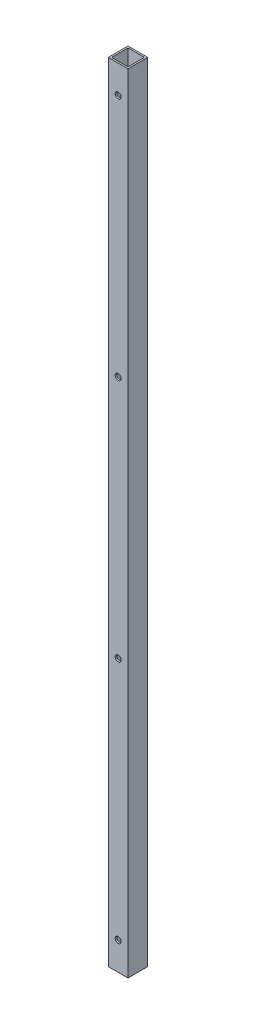
ISO-10303-21;
HEADER;
FILE_DESCRIPTION(('STEP AP214'),'2;1');
FILE_NAME('part.step','',(''),(''),'','','');
FILE_SCHEMA(('AUTOMOTIVE_DESIGN { 1 0 10303 214 1 1 1 1 }'));
ENDSEC;
DATA;
#1=APPLICATION_CONTEXT('core data for automotive mechanical design processes');
#2=APPLICATION_PROTOCOL_DEFINITION('international standard','automotive_design',2000,#1);
#3=PRODUCT_CONTEXT('',#1,'mechanical');
#4=PRODUCT('Part','Part','',(#3));
#5=PRODUCT_RELATED_PRODUCT_CATEGORY('part','',(#4));
#6=PRODUCT_DEFINITION_FORMATION('','',#4);
#7=PRODUCT_DEFINITION_CONTEXT('part definition',#1,'design');
#8=PRODUCT_DEFINITION('design','',#6,#7);
#9=PRODUCT_DEFINITION_SHAPE('','',#8);
#10=(LENGTH_UNIT() NAMED_UNIT(*) SI_UNIT(.MILLI.,.METRE.));
#11=(NAMED_UNIT(*) PLANE_ANGLE_UNIT() SI_UNIT($,.RADIAN.));
#12=(NAMED_UNIT(*) SI_UNIT($,.STERADIAN.) SOLID_ANGLE_UNIT());
#13=UNCERTAINTY_MEASURE_WITH_UNIT(LENGTH_MEASURE(1.E-05),#10,'distance_accuracy_value','');
#14=(GEOMETRIC_REPRESENTATION_CONTEXT(3) GLOBAL_UNCERTAINTY_ASSIGNED_CONTEXT((#13)) GLOBAL_UNIT_ASSIGNED_CONTEXT((#10,
#11,#12)) REPRESENTATION_CONTEXT('',''));
#15=CARTESIAN_POINT('',(0.,0.,0.));
#16=DIRECTION('',(0.,0.,1.));
#17=DIRECTION('',(1.,0.,0.));
#18=AXIS2_PLACEMENT_3D('',#15,#16,#17);
#19=CARTESIAN_POINT('',(0.,27.0016000000001,-9.5));
#20=DIRECTION('',(0.,0.,1.));
#21=DIRECTION('',(1.,0.,0.));
#22=AXIS2_PLACEMENT_3D('',#19,#20,#21);
#23=CYLINDRICAL_SURFACE('',#22,2.89559999999992);
#24=CARTESIAN_POINT('',(0.,27.0016000000001,7.9375));
#25=DIRECTION('',(0.,0.,-1.));
#26=DIRECTION('',(-1.,0.,0.));
#27=AXIS2_PLACEMENT_3D('',#24,#25,#26);
#28=CIRCLE('',#27,2.89559999999992);
#29=CARTESIAN_POINT('',(-2.89559999999992,27.0016000000001,7.9375));
#30=VERTEX_POINT('',#29);
#31=EDGE_CURVE('E40',#30,#30,#28,.T.);
#32=ORIENTED_EDGE('',*,*,#31,.T.);
#33=EDGE_LOOP('',(#32));
#34=FACE_BOUND('',#33,.T.);
#35=CARTESIAN_POINT('',(0.,27.0016000000001,9.5));
#36=DIRECTION('',(0.,0.,1.));
#37=DIRECTION('',(1.,0.,0.));
#38=AXIS2_PLACEMENT_3D('',#35,#36,#37);
#39=CIRCLE('',#38,2.89559999999992);
#40=CARTESIAN_POINT('',(2.89559999999992,27.0016000000001,9.5));
#41=VERTEX_POINT('',#40);
#42=EDGE_CURVE('E11',#41,#41,#39,.T.);
#43=ORIENTED_EDGE('',*,*,#42,.T.);
#44=EDGE_LOOP('',(#43));
#45=FACE_BOUND('',#44,.T.);
#46=ADVANCED_FACE('F33',(#34,#45),#23,.F.);
#47=CARTESIAN_POINT('',(0.,261.976066666667,-9.5));
#48=DIRECTION('',(0.,0.,1.));
#49=DIRECTION('',(1.,0.,0.));
#50=AXIS2_PLACEMENT_3D('',#47,#48,#49);
#51=CYLINDRICAL_SURFACE('',#50,2.89559999999992);
#52=CARTESIAN_POINT('',(0.,261.976066666667,7.9375));
#53=DIRECTION('',(0.,0.,-1.));
#54=DIRECTION('',(-1.,0.,0.));
#55=AXIS2_PLACEMENT_3D('',#52,#53,#54);
#56=CIRCLE('',#55,2.89559999999992);
#57=CARTESIAN_POINT('',(-2.89559999999992,261.976066666667,7.9375));
#58=VERTEX_POINT('',#57);
#59=EDGE_CURVE('E182',#58,#58,#56,.T.);
#60=ORIENTED_EDGE('',*,*,#59,.T.);
#61=EDGE_LOOP('',(#60));
#62=FACE_BOUND('',#61,.T.);
#63=CARTESIAN_POINT('',(0.,261.976066666667,9.5));
#64=DIRECTION('',(0.,0.,1.));
#65=DIRECTION('',(1.,0.,0.));
#66=AXIS2_PLACEMENT_3D('',#63,#64,#65);
#67=CIRCLE('',#66,2.89559999999992);
#68=CARTESIAN_POINT('',(2.89559999999992,261.976066666667,9.5));
#69=VERTEX_POINT('',#68);
#70=EDGE_CURVE('E185',#69,#69,#67,.T.);
#71=ORIENTED_EDGE('',*,*,#70,.T.);
#72=EDGE_LOOP('',(#71));
#73=FACE_BOUND('',#72,.T.);
#74=ADVANCED_FACE('F210',(#62,#73),#51,.F.);
#75=CARTESIAN_POINT('',(0.,27.0016000000001,-9.5));
#76=DIRECTION('',(0.,0.,1.));
#77=DIRECTION('',(1.,0.,0.));
#78=AXIS2_PLACEMENT_3D('',#75,#76,#77);
#79=CYLINDRICAL_SURFACE('',#78,2.89559999999992);
#80=CARTESIAN_POINT('',(0.,27.0016000000001,-7.9375));
#81=DIRECTION('',(0.,0.,1.));
#82=DIRECTION('',(1.,0.,0.));
#83=AXIS2_PLACEMENT_3D('',#80,#81,#82);
#84=CIRCLE('',#83,2.89559999999992);
#85=CARTESIAN_POINT('',(2.89559999999992,27.0016000000001,-7.9375));
#86=VERTEX_POINT('',#85);
#87=EDGE_CURVE('E176',#86,#86,#84,.T.);
#88=ORIENTED_EDGE('',*,*,#87,.T.);
#89=EDGE_LOOP('',(#88));
#90=FACE_BOUND('',#89,.T.);
#91=CARTESIAN_POINT('',(0.,27.0016000000001,-9.5));
#92=DIRECTION('',(0.,0.,1.));
#93=DIRECTION('',(1.,0.,0.));
#94=AXIS2_PLACEMENT_3D('',#91,#92,#93);
#95=CIRCLE('',#94,2.89559999999992);
#96=CARTESIAN_POINT('',(2.89559999999992,27.0016000000001,-9.5));
#97=VERTEX_POINT('',#96);
#98=EDGE_CURVE('E179',#97,#97,#95,.T.);
#99=ORIENTED_EDGE('',*,*,#98,.F.);
#100=EDGE_LOOP('',(#99));
#101=FACE_BOUND('',#100,.T.);
#102=ADVANCED_FACE('F214',(#90,#101),#79,.F.);
#103=CARTESIAN_POINT('',(0.,261.976066666667,-9.5));
#104=DIRECTION('',(0.,0.,1.));
#105=DIRECTION('',(1.,0.,0.));
#106=AXIS2_PLACEMENT_3D('',#103,#104,#105);
#107=CYLINDRICAL_SURFACE('',#106,2.89559999999992);
#108=CARTESIAN_POINT('',(0.,261.976066666667,-7.9375));
#109=DIRECTION('',(0.,0.,1.));
#110=DIRECTION('',(1.,0.,0.));
#111=AXIS2_PLACEMENT_3D('',#108,#109,#110);
#112=CIRCLE('',#111,2.89559999999992);
#113=CARTESIAN_POINT('',(2.89559999999992,261.976066666667,-7.9375));
#114=VERTEX_POINT('',#113);
#115=EDGE_CURVE('E166',#114,#114,#112,.T.);
#116=ORIENTED_EDGE('',*,*,#115,.T.);
#117=EDGE_LOOP('',(#116));
#118=FACE_BOUND('',#117,.T.);
#119=CARTESIAN_POINT('',(0.,261.976066666667,-9.5));
#120=DIRECTION('',(0.,0.,1.));
#121=DIRECTION('',(1.,0.,0.));
#122=AXIS2_PLACEMENT_3D('',#119,#120,#121);
#123=CIRCLE('',#122,2.89559999999992);
#124=CARTESIAN_POINT('',(2.89559999999992,261.976066666667,-9.5));
#125=VERTEX_POINT('',#124);
#126=EDGE_CURVE('E173',#125,#125,#123,.T.);
#127=ORIENTED_EDGE('',*,*,#126,.F.);
#128=EDGE_LOOP('',(#127));
#129=FACE_BOUND('',#128,.T.);
#130=ADVANCED_FACE('F219',(#118,#129),#107,.F.);
#131=CARTESIAN_POINT('',(0.,758.9266,0.));
#132=DIRECTION('',(0.,1.,0.));
#133=DIRECTION('',(0.,0.,1.));
#134=AXIS2_PLACEMENT_3D('',#131,#132,#133);
#135=PLANE('',#134);
#136=DIRECTION('',(0.,0.,-1.));
#137=VECTOR('',#136,1.);
#138=CARTESIAN_POINT('',(9.5,758.9266,-9.5));
#139=LINE('',#138,#137);
#140=CARTESIAN_POINT('',(9.5,758.9266,9.5));
#141=VERTEX_POINT('',#140);
#142=CARTESIAN_POINT('',(9.5,758.9266,-9.5));
#143=VERTEX_POINT('',#142);
#144=EDGE_CURVE('E137',#141,#143,#139,.T.);
#145=ORIENTED_EDGE('',*,*,#144,.T.);
#146=DIRECTION('',(-1.,0.,0.));
#147=VECTOR('',#146,1.);
#148=CARTESIAN_POINT('',(-9.5,758.9266,-9.5));
#149=LINE('',#148,#147);
#150=CARTESIAN_POINT('',(-9.5,758.9266,-9.5));
#151=VERTEX_POINT('',#150);
#152=EDGE_CURVE('E140',#143,#151,#149,.T.);
#153=ORIENTED_EDGE('',*,*,#152,.T.);
#154=DIRECTION('',(0.,0.,1.));
#155=VECTOR('',#154,1.);
#156=CARTESIAN_POINT('',(-9.5,758.9266,-9.5));
#157=LINE('',#156,#155);
#158=CARTESIAN_POINT('',(-9.5,758.9266,9.5));
#159=VERTEX_POINT('',#158);
#160=EDGE_CURVE('E143',#151,#159,#157,.T.);
#161=ORIENTED_EDGE('',*,*,#160,.T.);
#162=DIRECTION('',(1.,0.,0.));
#163=VECTOR('',#162,1.);
#164=CARTESIAN_POINT('',(-9.5,758.9266,9.5));
#165=LINE('',#164,#163);
#166=EDGE_CURVE('E145',#159,#141,#165,.T.);
#167=ORIENTED_EDGE('',*,*,#166,.T.);
#168=EDGE_LOOP('',(#145,#153,#161,#167));
#169=FACE_BOUND('',#168,.T.);
#170=DIRECTION('',(-1.,0.,0.));
#171=VECTOR('',#170,1.);
#172=CARTESIAN_POINT('',(-7.9375,758.9266,-7.9375));
#173=LINE('',#172,#171);
#174=CARTESIAN_POINT('',(7.9375,758.9266,-7.9375));
#175=VERTEX_POINT('',#174);
#176=CARTESIAN_POINT('',(-7.9375,758.9266,-7.9375));
#177=VERTEX_POINT('',#176);
#178=EDGE_CURVE('E105',#175,#177,#173,.T.);
#179=ORIENTED_EDGE('',*,*,#178,.F.);
#180=DIRECTION('',(0.,0.,-1.));
#181=VECTOR('',#180,1.);
#182=CARTESIAN_POINT('',(7.9375,758.9266,-7.9375));
#183=LINE('',#182,#181);
#184=CARTESIAN_POINT('',(7.9375,758.9266,7.9375));
#185=VERTEX_POINT('',#184);
#186=EDGE_CURVE('E97',#185,#175,#183,.T.);
#187=ORIENTED_EDGE('',*,*,#186,.F.);
#188=DIRECTION('',(1.,0.,0.));
#189=VECTOR('',#188,1.);
#190=CARTESIAN_POINT('',(-7.9375,758.9266,7.9375));
#191=LINE('',#190,#189);
#192=CARTESIAN_POINT('',(-7.9375,758.9266,7.9375));
#193=VERTEX_POINT('',#192);
#194=EDGE_CURVE('E121',#193,#185,#191,.T.);
#195=ORIENTED_EDGE('',*,*,#194,.F.);
#196=DIRECTION('',(0.,0.,1.));
#197=VECTOR('',#196,1.);
#198=CARTESIAN_POINT('',(-7.9375,758.9266,-7.9375));
#199=LINE('',#198,#197);
#200=EDGE_CURVE('E119',#177,#193,#199,.T.);
#201=ORIENTED_EDGE('',*,*,#200,.F.);
#202=EDGE_LOOP('',(#179,#187,#195,#201));
#203=FACE_BOUND('',#202,.T.);
#204=ADVANCED_FACE('F118',(#169,#203),#135,.T.);
#205=CARTESIAN_POINT('',(0.,0.,0.));
#206=DIRECTION('',(0.,1.,0.));
#207=DIRECTION('',(0.,0.,1.));
#208=AXIS2_PLACEMENT_3D('',#205,#206,#207);
#209=PLANE('',#208);
#210=DIRECTION('',(0.,0.,-1.));
#211=VECTOR('',#210,1.);
#212=CARTESIAN_POINT('',(9.5,0.,-9.5));
#213=LINE('',#212,#211);
#214=CARTESIAN_POINT('',(9.5,0.,9.5));
#215=VERTEX_POINT('',#214);
#216=CARTESIAN_POINT('',(9.5,0.,-9.5));
#217=VERTEX_POINT('',#216);
#218=EDGE_CURVE('E114',#215,#217,#213,.T.);
#219=ORIENTED_EDGE('',*,*,#218,.F.);
#220=DIRECTION('',(1.,0.,0.));
#221=VECTOR('',#220,1.);
#222=CARTESIAN_POINT('',(-9.5,0.,9.5));
#223=LINE('',#222,#221);
#224=CARTESIAN_POINT('',(-9.5,0.,9.5));
#225=VERTEX_POINT('',#224);
#226=EDGE_CURVE('E141',#225,#215,#223,.T.);
#227=ORIENTED_EDGE('',*,*,#226,.F.);
#228=DIRECTION('',(0.,0.,1.));
#229=VECTOR('',#228,1.);
#230=CARTESIAN_POINT('',(-9.5,0.,-9.5));
#231=LINE('',#230,#229);
#232=CARTESIAN_POINT('',(-9.5,0.,-9.5));
#233=VERTEX_POINT('',#232);
#234=EDGE_CURVE('E152',#233,#225,#231,.T.);
#235=ORIENTED_EDGE('',*,*,#234,.F.);
#236=DIRECTION('',(-1.,0.,0.));
#237=VECTOR('',#236,1.);
#238=CARTESIAN_POINT('',(-9.5,0.,-9.5));
#239=LINE('',#238,#237);
#240=EDGE_CURVE('E150',#217,#233,#239,.T.);
#241=ORIENTED_EDGE('',*,*,#240,.F.);
#242=EDGE_LOOP('',(#219,#227,#235,#241));
#243=FACE_BOUND('',#242,.T.);
#244=DIRECTION('',(0.,0.,-1.));
#245=VECTOR('',#244,1.);
#246=CARTESIAN_POINT('',(7.9375,0.,-7.9375));
#247=LINE('',#246,#245);
#248=CARTESIAN_POINT('',(7.9375,0.,7.9375));
#249=VERTEX_POINT('',#248);
#250=CARTESIAN_POINT('',(7.9375,0.,-7.9375));
#251=VERTEX_POINT('',#250);
#252=EDGE_CURVE('E55',#249,#251,#247,.T.);
#253=ORIENTED_EDGE('',*,*,#252,.T.);
#254=DIRECTION('',(-1.,0.,0.));
#255=VECTOR('',#254,1.);
#256=CARTESIAN_POINT('',(-7.9375,0.,-7.9375));
#257=LINE('',#256,#255);
#258=CARTESIAN_POINT('',(-7.9375,0.,-7.9375));
#259=VERTEX_POINT('',#258);
#260=EDGE_CURVE('E113',#251,#259,#257,.T.);
#261=ORIENTED_EDGE('',*,*,#260,.T.);
#262=DIRECTION('',(0.,0.,1.));
#263=VECTOR('',#262,1.);
#264=CARTESIAN_POINT('',(-7.9375,0.,-7.9375));
#265=LINE('',#264,#263);
#266=CARTESIAN_POINT('',(-7.9375,0.,7.9375));
#267=VERTEX_POINT('',#266);
#268=EDGE_CURVE('E129',#259,#267,#265,.T.);
#269=ORIENTED_EDGE('',*,*,#268,.T.);
#270=DIRECTION('',(1.,0.,0.));
#271=VECTOR('',#270,1.);
#272=CARTESIAN_POINT('',(-7.9375,0.,7.9375));
#273=LINE('',#272,#271);
#274=EDGE_CURVE('E106',#267,#249,#273,.T.);
#275=ORIENTED_EDGE('',*,*,#274,.T.);
#276=EDGE_LOOP('',(#253,#261,#269,#275));
#277=FACE_BOUND('',#276,.T.);
#278=ADVANCED_FACE('F231',(#243,#277),#209,.F.);
#279=CARTESIAN_POINT('',(9.5,758.9266,-9.5));
#280=DIRECTION('',(-1.,0.,0.));
#281=DIRECTION('',(0.,0.,1.));
#282=AXIS2_PLACEMENT_3D('',#279,#280,#281);
#283=PLANE('',#282);
#284=ORIENTED_EDGE('',*,*,#218,.T.);
#285=DIRECTION('',(0.,-1.,0.));
#286=VECTOR('',#285,1.);
#287=CARTESIAN_POINT('',(9.5,758.9266,-9.5));
#288=LINE('',#287,#286);
#289=EDGE_CURVE('E163',#143,#217,#288,.T.);
#290=ORIENTED_EDGE('',*,*,#289,.F.);
#291=ORIENTED_EDGE('',*,*,#144,.F.);
#292=DIRECTION('',(0.,-1.,0.));
#293=VECTOR('',#292,1.);
#294=CARTESIAN_POINT('',(9.5,758.9266,9.5));
#295=LINE('',#294,#293);
#296=EDGE_CURVE('E147',#141,#215,#295,.T.);
#297=ORIENTED_EDGE('',*,*,#296,.T.);
#298=EDGE_LOOP('',(#284,#290,#291,#297));
#299=FACE_BOUND('',#298,.T.);
#300=ADVANCED_FACE('F227',(#299),#283,.F.);
#301=CARTESIAN_POINT('',(-9.5,758.9266,-9.5));
#302=DIRECTION('',(0.,0.,1.));
#303=DIRECTION('',(1.,0.,0.));
#304=AXIS2_PLACEMENT_3D('',#301,#302,#303);
#305=PLANE('',#304);
#306=CARTESIAN_POINT('',(0.,496.950533333333,-9.5));
#307=DIRECTION('',(0.,0.,1.));
#308=DIRECTION('',(1.,0.,0.));
#309=AXIS2_PLACEMENT_3D('',#306,#307,#308);
#310=CIRCLE('',#309,2.89559999999992);
#311=CARTESIAN_POINT('',(2.89559999999992,496.950533333333,-9.5));
#312=VERTEX_POINT('',#311);
#313=EDGE_CURVE('E267',#312,#312,#310,.T.);
#314=ORIENTED_EDGE('',*,*,#313,.T.);
#315=EDGE_LOOP('',(#314));
#316=FACE_BOUND('',#315,.T.);
#317=CARTESIAN_POINT('',(0.,731.925,-9.5));
#318=DIRECTION('',(0.,0.,1.));
#319=DIRECTION('',(1.,0.,0.));
#320=AXIS2_PLACEMENT_3D('',#317,#318,#319);
#321=CIRCLE('',#320,2.89559999999992);
#322=CARTESIAN_POINT('',(2.89559999999992,731.925,-9.5));
#323=VERTEX_POINT('',#322);
#324=EDGE_CURVE('E170',#323,#323,#321,.T.);
#325=ORIENTED_EDGE('',*,*,#324,.T.);
#326=EDGE_LOOP('',(#325));
#327=FACE_BOUND('',#326,.T.);
#328=ORIENTED_EDGE('',*,*,#240,.T.);
#329=DIRECTION('',(0.,-1.,0.));
#330=VECTOR('',#329,1.);
#331=CARTESIAN_POINT('',(-9.5,758.9266,-9.5));
#332=LINE('',#331,#330);
#333=EDGE_CURVE('E160',#151,#233,#332,.T.);
#334=ORIENTED_EDGE('',*,*,#333,.F.);
#335=ORIENTED_EDGE('',*,*,#152,.F.);
#336=ORIENTED_EDGE('',*,*,#289,.T.);
#337=EDGE_LOOP('',(#328,#334,#335,#336));
#338=FACE_BOUND('',#337,.T.);
#339=ORIENTED_EDGE('',*,*,#126,.T.);
#340=EDGE_LOOP('',(#339));
#341=FACE_BOUND('',#340,.T.);
#342=ORIENTED_EDGE('',*,*,#98,.T.);
#343=EDGE_LOOP('',(#342));
#344=FACE_BOUND('',#343,.T.);
#345=ADVANCED_FACE('F230',(#316,#327,#338,#341,#344),#305,.F.);
#346=CARTESIAN_POINT('',(-9.5,758.9266,-9.5));
#347=DIRECTION('',(1.,0.,0.));
#348=DIRECTION('',(0.,0.,-1.));
#349=AXIS2_PLACEMENT_3D('',#346,#347,#348);
#350=PLANE('',#349);
#351=CARTESIAN_POINT('',(-9.5,84.5566,0.));
#352=DIRECTION('',(1.,0.,0.));
#353=DIRECTION('',(0.,0.,-1.));
#354=AXIS2_PLACEMENT_3D('',#351,#352,#353);
#355=CIRCLE('',#354,4.7625);
#356=CARTESIAN_POINT('',(-9.5,84.5566,-4.7625));
#357=VERTEX_POINT('',#356);
#358=EDGE_CURVE('E285',#357,#357,#355,.F.);
#359=ORIENTED_EDGE('',*,*,#358,.F.);
#360=EDGE_LOOP('',(#359));
#361=FACE_BOUND('',#360,.T.);
#362=CARTESIAN_POINT('',(-9.5,674.37,0.));
#363=DIRECTION('',(1.,0.,0.));
#364=DIRECTION('',(0.,0.,-1.));
#365=AXIS2_PLACEMENT_3D('',#362,#363,#364);
#366=CIRCLE('',#365,4.76250000000002);
#367=CARTESIAN_POINT('',(-9.5,674.37,-4.76250000000001));
#368=VERTEX_POINT('',#367);
#369=EDGE_CURVE('E279',#368,#368,#366,.F.);
#370=ORIENTED_EDGE('',*,*,#369,.F.);
#371=EDGE_LOOP('',(#370));
#372=FACE_BOUND('',#371,.T.);
#373=ORIENTED_EDGE('',*,*,#234,.T.);
#374=DIRECTION('',(0.,-1.,0.));
#375=VECTOR('',#374,1.);
#376=CARTESIAN_POINT('',(-9.5,758.9266,9.5));
#377=LINE('',#376,#375);
#378=EDGE_CURVE('E157',#159,#225,#377,.T.);
#379=ORIENTED_EDGE('',*,*,#378,.F.);
#380=ORIENTED_EDGE('',*,*,#160,.F.);
#381=ORIENTED_EDGE('',*,*,#333,.T.);
#382=EDGE_LOOP('',(#373,#379,#380,#381));
#383=FACE_BOUND('',#382,.T.);
#384=ADVANCED_FACE('F235',(#361,#372,#383),#350,.F.);
#385=CARTESIAN_POINT('',(-9.5,758.9266,9.5));
#386=DIRECTION('',(0.,0.,-1.));
#387=DIRECTION('',(-1.,0.,0.));
#388=AXIS2_PLACEMENT_3D('',#385,#386,#387);
#389=PLANE('',#388);
#390=CARTESIAN_POINT('',(0.,496.950533333333,9.5));
#391=DIRECTION('',(0.,0.,1.));
#392=DIRECTION('',(1.,0.,0.));
#393=AXIS2_PLACEMENT_3D('',#390,#391,#392);
#394=CIRCLE('',#393,2.89559999999992);
#395=CARTESIAN_POINT('',(2.89559999999992,496.950533333333,9.5));
#396=VERTEX_POINT('',#395);
#397=EDGE_CURVE('E273',#396,#396,#394,.T.);
#398=ORIENTED_EDGE('',*,*,#397,.F.);
#399=EDGE_LOOP('',(#398));
#400=FACE_BOUND('',#399,.T.);
#401=CARTESIAN_POINT('',(0.,731.925,9.5));
#402=DIRECTION('',(0.,0.,1.));
#403=DIRECTION('',(1.,0.,0.));
#404=AXIS2_PLACEMENT_3D('',#401,#402,#403);
#405=CIRCLE('',#404,2.89559999999992);
#406=CARTESIAN_POINT('',(2.89559999999992,731.925,9.5));
#407=VERTEX_POINT('',#406);
#408=EDGE_CURVE('E264',#407,#407,#405,.T.);
#409=ORIENTED_EDGE('',*,*,#408,.F.);
#410=EDGE_LOOP('',(#409));
#411=FACE_BOUND('',#410,.T.);
#412=ORIENTED_EDGE('',*,*,#226,.T.);
#413=ORIENTED_EDGE('',*,*,#296,.F.);
#414=ORIENTED_EDGE('',*,*,#166,.F.);
#415=ORIENTED_EDGE('',*,*,#378,.T.);
#416=EDGE_LOOP('',(#412,#413,#414,#415));
#417=FACE_BOUND('',#416,.T.);
#418=ORIENTED_EDGE('',*,*,#70,.F.);
#419=EDGE_LOOP('',(#418));
#420=FACE_BOUND('',#419,.T.);
#421=ORIENTED_EDGE('',*,*,#42,.F.);
#422=EDGE_LOOP('',(#421));
#423=FACE_BOUND('',#422,.T.);
#424=ADVANCED_FACE('F239',(#400,#411,#417,#420,#423),#389,.F.);
#425=CARTESIAN_POINT('',(7.9375,758.9266,-7.9375));
#426=DIRECTION('',(-1.,0.,0.));
#427=DIRECTION('',(0.,0.,1.));
#428=AXIS2_PLACEMENT_3D('',#425,#426,#427);
#429=PLANE('',#428);
#430=ORIENTED_EDGE('',*,*,#252,.F.);
#431=DIRECTION('',(0.,-1.,0.));
#432=VECTOR('',#431,1.);
#433=CARTESIAN_POINT('',(7.9375,758.9266,7.9375));
#434=LINE('',#433,#432);
#435=EDGE_CURVE('E101',#185,#249,#434,.T.);
#436=ORIENTED_EDGE('',*,*,#435,.F.);
#437=ORIENTED_EDGE('',*,*,#186,.T.);
#438=DIRECTION('',(0.,-1.,0.));
#439=VECTOR('',#438,1.);
#440=CARTESIAN_POINT('',(7.9375,758.9266,-7.9375));
#441=LINE('',#440,#439);
#442=EDGE_CURVE('E100',#175,#251,#441,.T.);
#443=ORIENTED_EDGE('',*,*,#442,.T.);
#444=EDGE_LOOP('',(#430,#436,#437,#443));
#445=FACE_BOUND('',#444,.T.);
#446=ADVANCED_FACE('F99',(#445),#429,.T.);
#447=CARTESIAN_POINT('',(-7.9375,758.9266,-7.9375));
#448=DIRECTION('',(0.,0.,1.));
#449=DIRECTION('',(1.,0.,0.));
#450=AXIS2_PLACEMENT_3D('',#447,#448,#449);
#451=PLANE('',#450);
#452=CARTESIAN_POINT('',(0.,496.950533333333,-7.9375));
#453=DIRECTION('',(0.,0.,1.));
#454=DIRECTION('',(1.,0.,0.));
#455=AXIS2_PLACEMENT_3D('',#452,#453,#454);
#456=CIRCLE('',#455,2.89559999999992);
#457=CARTESIAN_POINT('',(2.89559999999992,496.950533333333,-7.9375));
#458=VERTEX_POINT('',#457);
#459=EDGE_CURVE('E259',#458,#458,#456,.T.);
#460=ORIENTED_EDGE('',*,*,#459,.F.);
#461=EDGE_LOOP('',(#460));
#462=FACE_BOUND('',#461,.T.);
#463=CARTESIAN_POINT('',(0.,731.925,-7.9375));
#464=DIRECTION('',(0.,0.,1.));
#465=DIRECTION('',(1.,0.,0.));
#466=AXIS2_PLACEMENT_3D('',#463,#464,#465);
#467=CIRCLE('',#466,2.89559999999992);
#468=CARTESIAN_POINT('',(2.89559999999992,731.925,-7.9375));
#469=VERTEX_POINT('',#468);
#470=EDGE_CURVE('E127',#469,#469,#467,.T.);
#471=ORIENTED_EDGE('',*,*,#470,.F.);
#472=EDGE_LOOP('',(#471));
#473=FACE_BOUND('',#472,.T.);
#474=ORIENTED_EDGE('',*,*,#260,.F.);
#475=ORIENTED_EDGE('',*,*,#442,.F.);
#476=ORIENTED_EDGE('',*,*,#178,.T.);
#477=DIRECTION('',(0.,-1.,0.));
#478=VECTOR('',#477,1.);
#479=CARTESIAN_POINT('',(-7.9375,758.9266,-7.9375));
#480=LINE('',#479,#478);
#481=EDGE_CURVE('E115',#177,#259,#480,.T.);
#482=ORIENTED_EDGE('',*,*,#481,.T.);
#483=EDGE_LOOP('',(#474,#475,#476,#482));
#484=FACE_BOUND('',#483,.T.);
#485=ORIENTED_EDGE('',*,*,#115,.F.);
#486=EDGE_LOOP('',(#485));
#487=FACE_BOUND('',#486,.T.);
#488=ORIENTED_EDGE('',*,*,#87,.F.);
#489=EDGE_LOOP('',(#488));
#490=FACE_BOUND('',#489,.T.);
#491=ADVANCED_FACE('F109',(#462,#473,#484,#487,#490),#451,.T.);
#492=CARTESIAN_POINT('',(-7.9375,758.9266,-7.9375));
#493=DIRECTION('',(1.,0.,0.));
#494=DIRECTION('',(0.,0.,-1.));
#495=AXIS2_PLACEMENT_3D('',#492,#493,#494);
#496=PLANE('',#495);
#497=CARTESIAN_POINT('',(-7.9375,84.5566,0.));
#498=DIRECTION('',(1.,0.,0.));
#499=DIRECTION('',(0.,0.,-1.));
#500=AXIS2_PLACEMENT_3D('',#497,#498,#499);
#501=CIRCLE('',#500,4.7625);
#502=CARTESIAN_POINT('',(-7.9375,84.5566,-4.7625));
#503=VERTEX_POINT('',#502);
#504=EDGE_CURVE('E288',#503,#503,#501,.F.);
#505=ORIENTED_EDGE('',*,*,#504,.T.);
#506=EDGE_LOOP('',(#505));
#507=FACE_BOUND('',#506,.T.);
#508=CARTESIAN_POINT('',(-7.9375,674.37,0.));
#509=DIRECTION('',(1.,0.,0.));
#510=DIRECTION('',(0.,0.,-1.));
#511=AXIS2_PLACEMENT_3D('',#508,#509,#510);
#512=CIRCLE('',#511,4.76250000000002);
#513=CARTESIAN_POINT('',(-7.9375,674.37,-4.76250000000001));
#514=VERTEX_POINT('',#513);
#515=EDGE_CURVE('E282',#514,#514,#512,.F.);
#516=ORIENTED_EDGE('',*,*,#515,.T.);
#517=EDGE_LOOP('',(#516));
#518=FACE_BOUND('',#517,.T.);
#519=ORIENTED_EDGE('',*,*,#268,.F.);
#520=ORIENTED_EDGE('',*,*,#481,.F.);
#521=ORIENTED_EDGE('',*,*,#200,.T.);
#522=DIRECTION('',(0.,-1.,0.));
#523=VECTOR('',#522,1.);
#524=CARTESIAN_POINT('',(-7.9375,758.9266,7.9375));
#525=LINE('',#524,#523);
#526=EDGE_CURVE('E47',#193,#267,#525,.T.);
#527=ORIENTED_EDGE('',*,*,#526,.T.);
#528=EDGE_LOOP('',(#519,#520,#521,#527));
#529=FACE_BOUND('',#528,.T.);
#530=ADVANCED_FACE('F195',(#507,#518,#529),#496,.T.);
#531=CARTESIAN_POINT('',(-7.9375,758.9266,7.9375));
#532=DIRECTION('',(0.,0.,-1.));
#533=DIRECTION('',(-1.,0.,0.));
#534=AXIS2_PLACEMENT_3D('',#531,#532,#533);
#535=PLANE('',#534);
#536=CARTESIAN_POINT('',(0.,496.950533333333,7.9375));
#537=DIRECTION('',(0.,0.,-1.));
#538=DIRECTION('',(-1.,0.,0.));
#539=AXIS2_PLACEMENT_3D('',#536,#537,#538);
#540=CIRCLE('',#539,2.89559999999992);
#541=CARTESIAN_POINT('',(-2.89559999999992,496.950533333333,7.9375));
#542=VERTEX_POINT('',#541);
#543=EDGE_CURVE('E276',#542,#542,#540,.T.);
#544=ORIENTED_EDGE('',*,*,#543,.F.);
#545=EDGE_LOOP('',(#544));
#546=FACE_BOUND('',#545,.T.);
#547=CARTESIAN_POINT('',(0.,731.925,7.9375));
#548=DIRECTION('',(0.,0.,-1.));
#549=DIRECTION('',(-1.,0.,0.));
#550=AXIS2_PLACEMENT_3D('',#547,#548,#549);
#551=CIRCLE('',#550,2.89559999999992);
#552=CARTESIAN_POINT('',(-2.89559999999992,731.925,7.9375));
#553=VERTEX_POINT('',#552);
#554=EDGE_CURVE('E167',#553,#553,#551,.T.);
#555=ORIENTED_EDGE('',*,*,#554,.F.);
#556=EDGE_LOOP('',(#555));
#557=FACE_BOUND('',#556,.T.);
#558=ORIENTED_EDGE('',*,*,#274,.F.);
#559=ORIENTED_EDGE('',*,*,#526,.F.);
#560=ORIENTED_EDGE('',*,*,#194,.T.);
#561=ORIENTED_EDGE('',*,*,#435,.T.);
#562=EDGE_LOOP('',(#558,#559,#560,#561));
#563=FACE_BOUND('',#562,.T.);
#564=ORIENTED_EDGE('',*,*,#59,.F.);
#565=EDGE_LOOP('',(#564));
#566=FACE_BOUND('',#565,.T.);
#567=ORIENTED_EDGE('',*,*,#31,.F.);
#568=EDGE_LOOP('',(#567));
#569=FACE_BOUND('',#568,.T.);
#570=ADVANCED_FACE('F192',(#546,#557,#563,#566,#569),#535,.T.);
#571=CARTESIAN_POINT('',(0.,731.925,-9.5));
#572=DIRECTION('',(0.,0.,1.));
#573=DIRECTION('',(1.,0.,0.));
#574=AXIS2_PLACEMENT_3D('',#571,#572,#573);
#575=CYLINDRICAL_SURFACE('',#574,2.89559999999992);
#576=ORIENTED_EDGE('',*,*,#554,.T.);
#577=EDGE_LOOP('',(#576));
#578=FACE_BOUND('',#577,.T.);
#579=ORIENTED_EDGE('',*,*,#408,.T.);
#580=EDGE_LOOP('',(#579));
#581=FACE_BOUND('',#580,.T.);
#582=ADVANCED_FACE('F194',(#578,#581),#575,.F.);
#583=ORIENTED_EDGE('',*,*,#470,.T.);
#584=EDGE_LOOP('',(#583));
#585=FACE_BOUND('',#584,.T.);
#586=ORIENTED_EDGE('',*,*,#324,.F.);
#587=EDGE_LOOP('',(#586));
#588=FACE_BOUND('',#587,.T.);
#589=ADVANCED_FACE('F202',(#585,#588),#575,.F.);
#590=CARTESIAN_POINT('',(0.,496.950533333333,-9.5));
#591=DIRECTION('',(0.,0.,1.));
#592=DIRECTION('',(1.,0.,0.));
#593=AXIS2_PLACEMENT_3D('',#590,#591,#592);
#594=CYLINDRICAL_SURFACE('',#593,2.89559999999992);
#595=ORIENTED_EDGE('',*,*,#459,.T.);
#596=EDGE_LOOP('',(#595));
#597=FACE_BOUND('',#596,.T.);
#598=ORIENTED_EDGE('',*,*,#313,.F.);
#599=EDGE_LOOP('',(#598));
#600=FACE_BOUND('',#599,.T.);
#601=ADVANCED_FACE('F337',(#597,#600),#594,.F.);
#602=CARTESIAN_POINT('',(0.,496.950533333333,-9.5));
#603=DIRECTION('',(0.,0.,1.));
#604=DIRECTION('',(1.,0.,0.));
#605=AXIS2_PLACEMENT_3D('',#602,#603,#604);
#606=CYLINDRICAL_SURFACE('',#605,2.89559999999992);
#607=ORIENTED_EDGE('',*,*,#543,.T.);
#608=EDGE_LOOP('',(#607));
#609=FACE_BOUND('',#608,.T.);
#610=ORIENTED_EDGE('',*,*,#397,.T.);
#611=EDGE_LOOP('',(#610));
#612=FACE_BOUND('',#611,.T.);
#613=ADVANCED_FACE('F331',(#609,#612),#606,.F.);
#614=CARTESIAN_POINT('',(-9.500012,674.37,0.));
#615=DIRECTION('',(1.,0.,0.));
#616=DIRECTION('',(0.,0.,-1.));
#617=AXIS2_PLACEMENT_3D('',#614,#615,#616);
#618=CYLINDRICAL_SURFACE('',#617,4.76250000000002);
#619=ORIENTED_EDGE('',*,*,#515,.F.);
#620=EDGE_LOOP('',(#619));
#621=FACE_BOUND('',#620,.T.);
#622=ORIENTED_EDGE('',*,*,#369,.T.);
#623=EDGE_LOOP('',(#622));
#624=FACE_BOUND('',#623,.T.);
#625=ADVANCED_FACE('F296',(#621,#624),#618,.F.);
#626=CARTESIAN_POINT('',(-9.500012,84.5566,0.));
#627=DIRECTION('',(1.,0.,0.));
#628=DIRECTION('',(0.,0.,-1.));
#629=AXIS2_PLACEMENT_3D('',#626,#627,#628);
#630=CYLINDRICAL_SURFACE('',#629,4.7625);
#631=ORIENTED_EDGE('',*,*,#504,.F.);
#632=EDGE_LOOP('',(#631));
#633=FACE_BOUND('',#632,.T.);
#634=ORIENTED_EDGE('',*,*,#358,.T.);
#635=EDGE_LOOP('',(#634));
#636=FACE_BOUND('',#635,.T.);
#637=ADVANCED_FACE('F293',(#633,#636),#630,.F.);
#638=CLOSED_SHELL('',(#46,#74,#102,#130,#204,#278,#300,#345,#384,#424,#446,#491,#530,#570,#582,
#589,#601,#613,#625,#637));
#639=MANIFOLD_SOLID_BREP('B2',#638);
#640=ADVANCED_BREP_SHAPE_REPRESENTATION('',(#18,#639),#14);
#641=SHAPE_DEFINITION_REPRESENTATION(#9,#640);
ENDSEC;
END-ISO-10303-21;
